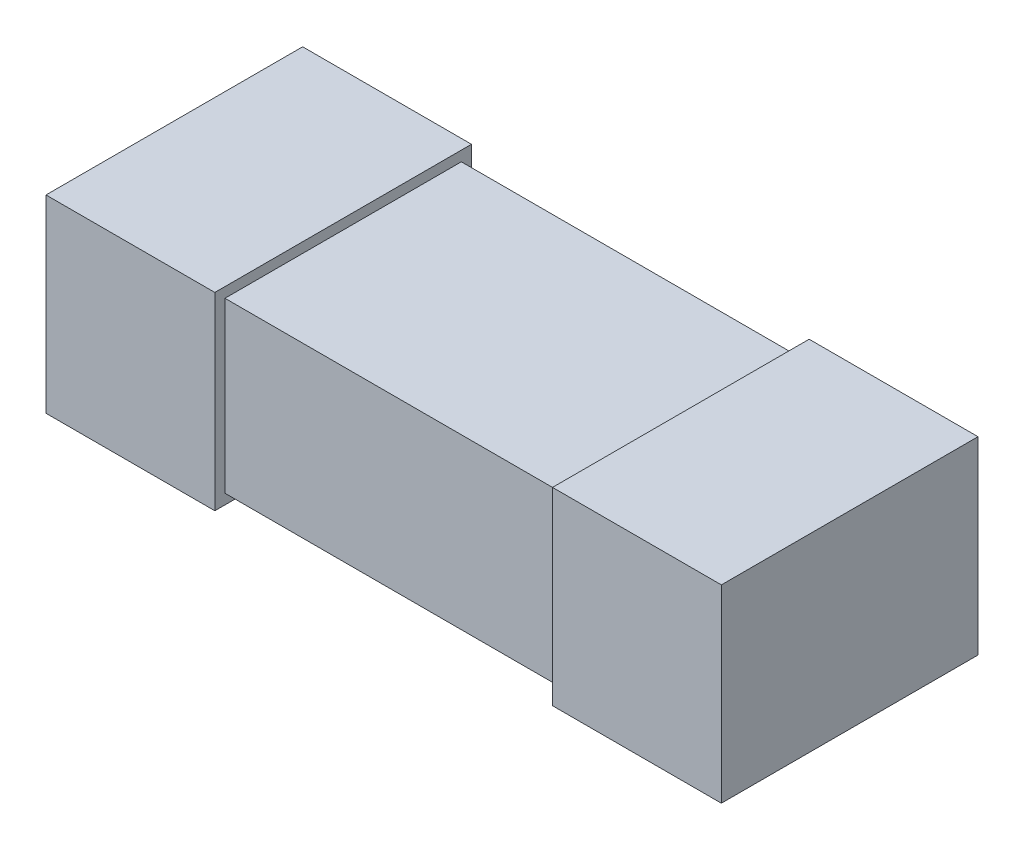
ISO-10303-21;
HEADER;
FILE_DESCRIPTION(('STEP AP214'),'2;1');
FILE_NAME('part.step','',(''),(''),'','','');
FILE_SCHEMA(('AUTOMOTIVE_DESIGN { 1 0 10303 214 1 1 1 1 }'));
ENDSEC;
DATA;
#1=APPLICATION_CONTEXT('core data for automotive mechanical design processes');
#2=APPLICATION_PROTOCOL_DEFINITION('international standard','automotive_design',2000,#1);
#3=PRODUCT_CONTEXT('',#1,'mechanical');
#4=PRODUCT('Part','Part','',(#3));
#5=PRODUCT_RELATED_PRODUCT_CATEGORY('part','',(#4));
#6=PRODUCT_DEFINITION_FORMATION('','',#4);
#7=PRODUCT_DEFINITION_CONTEXT('part definition',#1,'design');
#8=PRODUCT_DEFINITION('design','',#6,#7);
#9=PRODUCT_DEFINITION_SHAPE('','',#8);
#10=(LENGTH_UNIT() NAMED_UNIT(*) SI_UNIT(.MILLI.,.METRE.));
#11=(NAMED_UNIT(*) PLANE_ANGLE_UNIT() SI_UNIT($,.RADIAN.));
#12=(NAMED_UNIT(*) SI_UNIT($,.STERADIAN.) SOLID_ANGLE_UNIT());
#13=UNCERTAINTY_MEASURE_WITH_UNIT(LENGTH_MEASURE(1.E-05),#10,'distance_accuracy_value','');
#14=(GEOMETRIC_REPRESENTATION_CONTEXT(3) GLOBAL_UNCERTAINTY_ASSIGNED_CONTEXT((#13)) GLOBAL_UNIT_ASSIGNED_CONTEXT((#10,
#11,#12)) REPRESENTATION_CONTEXT('',''));
#15=CARTESIAN_POINT('',(0.,0.,0.));
#16=DIRECTION('',(0.,0.,1.));
#17=DIRECTION('',(1.,0.,0.));
#18=AXIS2_PLACEMENT_3D('',#15,#16,#17);
#19=CARTESIAN_POINT('',(-1.,0.5,0.35));
#20=DIRECTION('',(0.,0.,-1.));
#21=DIRECTION('',(-1.,0.,0.));
#22=AXIS2_PLACEMENT_3D('',#19,#20,#21);
#23=PLANE('',#22);
#24=DIRECTION('',(1.,0.,0.));
#25=VECTOR('',#24,1.);
#26=CARTESIAN_POINT('',(-1.,0.,0.35));
#27=LINE('',#26,#25);
#28=CARTESIAN_POINT('',(-0.5,0.,0.35));
#29=VERTEX_POINT('',#28);
#30=CARTESIAN_POINT('',(0.5,0.,0.35));
#31=VERTEX_POINT('',#30);
#32=EDGE_CURVE('E212',#29,#31,#27,.T.);
#33=ORIENTED_EDGE('',*,*,#32,.T.);
#34=DIRECTION('',(0.,1.,0.));
#35=VECTOR('',#34,1.);
#36=CARTESIAN_POINT('',(0.5,0.5,0.35));
#37=LINE('',#36,#35);
#38=CARTESIAN_POINT('',(0.5,0.5,0.35));
#39=VERTEX_POINT('',#38);
#40=EDGE_CURVE('E48',#31,#39,#37,.T.);
#41=ORIENTED_EDGE('',*,*,#40,.T.);
#42=DIRECTION('',(1.,0.,0.));
#43=VECTOR('',#42,1.);
#44=CARTESIAN_POINT('',(-1.,0.5,0.35));
#45=LINE('',#44,#43);
#46=CARTESIAN_POINT('',(-0.5,0.5,0.35));
#47=VERTEX_POINT('',#46);
#48=EDGE_CURVE('E213',#47,#39,#45,.T.);
#49=ORIENTED_EDGE('',*,*,#48,.F.);
#50=DIRECTION('',(0.,-1.,0.));
#51=VECTOR('',#50,1.);
#52=CARTESIAN_POINT('',(-0.5,0.5,0.35));
#53=LINE('',#52,#51);
#54=EDGE_CURVE('E207',#47,#29,#53,.T.);
#55=ORIENTED_EDGE('',*,*,#54,.T.);
#56=EDGE_LOOP('',(#33,#41,#49,#55));
#57=FACE_BOUND('',#56,.T.);
#58=ADVANCED_FACE('F33',(#57),#23,.F.);
#59=CARTESIAN_POINT('',(-1.,0.5,-0.35));
#60=DIRECTION('',(0.,0.,1.));
#61=DIRECTION('',(1.,0.,0.));
#62=AXIS2_PLACEMENT_3D('',#59,#60,#61);
#63=PLANE('',#62);
#64=DIRECTION('',(-1.,0.,0.));
#65=VECTOR('',#64,1.);
#66=CARTESIAN_POINT('',(-1.,0.5,-0.35));
#67=LINE('',#66,#65);
#68=CARTESIAN_POINT('',(0.5,0.5,-0.35));
#69=VERTEX_POINT('',#68);
#70=CARTESIAN_POINT('',(-0.5,0.5,-0.35));
#71=VERTEX_POINT('',#70);
#72=EDGE_CURVE('E215',#69,#71,#67,.T.);
#73=ORIENTED_EDGE('',*,*,#72,.F.);
#74=DIRECTION('',(0.,-1.,0.));
#75=VECTOR('',#74,1.);
#76=CARTESIAN_POINT('',(0.5,0.5,-0.35));
#77=LINE('',#76,#75);
#78=CARTESIAN_POINT('',(0.5,0.,-0.35));
#79=VERTEX_POINT('',#78);
#80=EDGE_CURVE('E163',#69,#79,#77,.T.);
#81=ORIENTED_EDGE('',*,*,#80,.T.);
#82=DIRECTION('',(-1.,0.,0.));
#83=VECTOR('',#82,1.);
#84=CARTESIAN_POINT('',(-1.,0.,-0.35));
#85=LINE('',#84,#83);
#86=CARTESIAN_POINT('',(-0.5,0.,-0.35));
#87=VERTEX_POINT('',#86);
#88=EDGE_CURVE('E216',#79,#87,#85,.T.);
#89=ORIENTED_EDGE('',*,*,#88,.T.);
#90=DIRECTION('',(0.,1.,0.));
#91=VECTOR('',#90,1.);
#92=CARTESIAN_POINT('',(-0.5,0.5,-0.35));
#93=LINE('',#92,#91);
#94=EDGE_CURVE('E199',#87,#71,#93,.T.);
#95=ORIENTED_EDGE('',*,*,#94,.T.);
#96=EDGE_LOOP('',(#73,#81,#89,#95));
#97=FACE_BOUND('',#96,.T.);
#98=ADVANCED_FACE('F231',(#97),#63,.F.);
#99=CARTESIAN_POINT('',(0.,0.5,0.));
#100=DIRECTION('',(0.,-1.,0.));
#101=DIRECTION('',(0.,0.,-1.));
#102=AXIS2_PLACEMENT_3D('',#99,#100,#101);
#103=PLANE('',#102);
#104=ORIENTED_EDGE('',*,*,#48,.T.);
#105=DIRECTION('',(0.,0.,-1.));
#106=VECTOR('',#105,1.);
#107=CARTESIAN_POINT('',(0.5,0.5,0.));
#108=LINE('',#107,#106);
#109=EDGE_CURVE('E55',#39,#69,#108,.T.);
#110=ORIENTED_EDGE('',*,*,#109,.T.);
#111=ORIENTED_EDGE('',*,*,#72,.T.);
#112=DIRECTION('',(0.,0.,1.));
#113=VECTOR('',#112,1.);
#114=CARTESIAN_POINT('',(-0.5,0.5,0.));
#115=LINE('',#114,#113);
#116=EDGE_CURVE('E210',#71,#47,#115,.T.);
#117=ORIENTED_EDGE('',*,*,#116,.T.);
#118=EDGE_LOOP('',(#104,#110,#111,#117));
#119=FACE_BOUND('',#118,.T.);
#120=ADVANCED_FACE('F228',(#119),#103,.F.);
#121=CARTESIAN_POINT('',(0.,0.,0.));
#122=DIRECTION('',(0.,-1.,0.));
#123=DIRECTION('',(0.,0.,-1.));
#124=AXIS2_PLACEMENT_3D('',#121,#122,#123);
#125=PLANE('',#124);
#126=DIRECTION('',(0.,0.,-1.));
#127=VECTOR('',#126,1.);
#128=CARTESIAN_POINT('',(0.5,0.,0.));
#129=LINE('',#128,#127);
#130=EDGE_CURVE('E11',#31,#79,#129,.T.);
#131=ORIENTED_EDGE('',*,*,#130,.F.);
#132=ORIENTED_EDGE('',*,*,#32,.F.);
#133=DIRECTION('',(0.,0.,1.));
#134=VECTOR('',#133,1.);
#135=CARTESIAN_POINT('',(-0.5,0.,0.));
#136=LINE('',#135,#134);
#137=EDGE_CURVE('E41',#87,#29,#136,.T.);
#138=ORIENTED_EDGE('',*,*,#137,.F.);
#139=ORIENTED_EDGE('',*,*,#88,.F.);
#140=EDGE_LOOP('',(#131,#132,#138,#139));
#141=FACE_BOUND('',#140,.T.);
#142=ADVANCED_FACE('F227',(#141),#125,.T.);
#143=CARTESIAN_POINT('',(-0.5,0.,0.));
#144=DIRECTION('',(1.,0.,0.));
#145=DIRECTION('',(0.,0.,-1.));
#146=AXIS2_PLACEMENT_3D('',#143,#144,#145);
#147=PLANE('',#146);
#148=DIRECTION('',(0.,-1.,0.));
#149=VECTOR('',#148,1.);
#150=CARTESIAN_POINT('',(-0.5,-0.03,-0.38));
#151=LINE('',#150,#149);
#152=CARTESIAN_POINT('',(-0.5,0.53,-0.38));
#153=VERTEX_POINT('',#152);
#154=CARTESIAN_POINT('',(-0.5,-0.03,-0.38));
#155=VERTEX_POINT('',#154);
#156=EDGE_CURVE('E173',#153,#155,#151,.T.);
#157=ORIENTED_EDGE('',*,*,#156,.F.);
#158=DIRECTION('',(0.,0.,-1.));
#159=VECTOR('',#158,1.);
#160=CARTESIAN_POINT('',(-0.5,0.53,-0.38));
#161=LINE('',#160,#159);
#162=CARTESIAN_POINT('',(-0.5,0.53,0.38));
#163=VERTEX_POINT('',#162);
#164=EDGE_CURVE('E183',#163,#153,#161,.T.);
#165=ORIENTED_EDGE('',*,*,#164,.F.);
#166=DIRECTION('',(0.,1.,0.));
#167=VECTOR('',#166,1.);
#168=CARTESIAN_POINT('',(-0.5,-0.03,0.38));
#169=LINE('',#168,#167);
#170=CARTESIAN_POINT('',(-0.5,-0.03,0.38));
#171=VERTEX_POINT('',#170);
#172=EDGE_CURVE('E180',#171,#163,#169,.T.);
#173=ORIENTED_EDGE('',*,*,#172,.F.);
#174=DIRECTION('',(0.,0.,1.));
#175=VECTOR('',#174,1.);
#176=CARTESIAN_POINT('',(-0.5,-0.03,-0.38));
#177=LINE('',#176,#175);
#178=EDGE_CURVE('E176',#155,#171,#177,.T.);
#179=ORIENTED_EDGE('',*,*,#178,.F.);
#180=EDGE_LOOP('',(#157,#165,#173,#179));
#181=FACE_BOUND('',#180,.T.);
#182=ORIENTED_EDGE('',*,*,#116,.F.);
#183=ORIENTED_EDGE('',*,*,#94,.F.);
#184=ORIENTED_EDGE('',*,*,#137,.T.);
#185=ORIENTED_EDGE('',*,*,#54,.F.);
#186=EDGE_LOOP('',(#182,#183,#184,#185));
#187=FACE_BOUND('',#186,.T.);
#188=ADVANCED_FACE('F225',(#181,#187),#147,.T.);
#189=CARTESIAN_POINT('',(-0.5,-0.03,-0.38));
#190=DIRECTION('',(0.,0.,-1.));
#191=DIRECTION('',(-1.,0.,0.));
#192=AXIS2_PLACEMENT_3D('',#189,#190,#191);
#193=PLANE('',#192);
#194=DIRECTION('',(0.,-1.,0.));
#195=VECTOR('',#194,1.);
#196=CARTESIAN_POINT('',(-1.,-0.03,-0.38));
#197=LINE('',#196,#195);
#198=CARTESIAN_POINT('',(-1.,0.53,-0.38));
#199=VERTEX_POINT('',#198);
#200=CARTESIAN_POINT('',(-1.,-0.03,-0.38));
#201=VERTEX_POINT('',#200);
#202=EDGE_CURVE('E172',#199,#201,#197,.T.);
#203=ORIENTED_EDGE('',*,*,#202,.F.);
#204=DIRECTION('',(-1.,0.,0.));
#205=VECTOR('',#204,1.);
#206=CARTESIAN_POINT('',(-0.5,0.53,-0.38));
#207=LINE('',#206,#205);
#208=EDGE_CURVE('E197',#153,#199,#207,.T.);
#209=ORIENTED_EDGE('',*,*,#208,.F.);
#210=ORIENTED_EDGE('',*,*,#156,.T.);
#211=DIRECTION('',(-1.,0.,0.));
#212=VECTOR('',#211,1.);
#213=CARTESIAN_POINT('',(-0.5,-0.03,-0.38));
#214=LINE('',#213,#212);
#215=EDGE_CURVE('E186',#155,#201,#214,.T.);
#216=ORIENTED_EDGE('',*,*,#215,.T.);
#217=EDGE_LOOP('',(#203,#209,#210,#216));
#218=FACE_BOUND('',#217,.T.);
#219=ADVANCED_FACE('F266',(#218),#193,.T.);
#220=CARTESIAN_POINT('',(-0.5,0.53,-0.38));
#221=DIRECTION('',(0.,1.,0.));
#222=DIRECTION('',(0.,0.,1.));
#223=AXIS2_PLACEMENT_3D('',#220,#221,#222);
#224=PLANE('',#223);
#225=DIRECTION('',(0.,0.,-1.));
#226=VECTOR('',#225,1.);
#227=CARTESIAN_POINT('',(-1.,0.53,-0.38));
#228=LINE('',#227,#226);
#229=CARTESIAN_POINT('',(-1.,0.53,0.38));
#230=VERTEX_POINT('',#229);
#231=EDGE_CURVE('E177',#230,#199,#228,.T.);
#232=ORIENTED_EDGE('',*,*,#231,.F.);
#233=DIRECTION('',(-1.,0.,0.));
#234=VECTOR('',#233,1.);
#235=CARTESIAN_POINT('',(-0.5,0.53,0.38));
#236=LINE('',#235,#234);
#237=EDGE_CURVE('E200',#163,#230,#236,.T.);
#238=ORIENTED_EDGE('',*,*,#237,.F.);
#239=ORIENTED_EDGE('',*,*,#164,.T.);
#240=ORIENTED_EDGE('',*,*,#208,.T.);
#241=EDGE_LOOP('',(#232,#238,#239,#240));
#242=FACE_BOUND('',#241,.T.);
#243=ADVANCED_FACE('F268',(#242),#224,.T.);
#244=CARTESIAN_POINT('',(-0.5,-0.03,0.38));
#245=DIRECTION('',(0.,0.,1.));
#246=DIRECTION('',(1.,0.,0.));
#247=AXIS2_PLACEMENT_3D('',#244,#245,#246);
#248=PLANE('',#247);
#249=DIRECTION('',(0.,1.,0.));
#250=VECTOR('',#249,1.);
#251=CARTESIAN_POINT('',(-1.,-0.03,0.38));
#252=LINE('',#251,#250);
#253=CARTESIAN_POINT('',(-1.,-0.03,0.38));
#254=VERTEX_POINT('',#253);
#255=EDGE_CURVE('E192',#254,#230,#252,.T.);
#256=ORIENTED_EDGE('',*,*,#255,.F.);
#257=DIRECTION('',(-1.,0.,0.));
#258=VECTOR('',#257,1.);
#259=CARTESIAN_POINT('',(-0.5,-0.03,0.38));
#260=LINE('',#259,#258);
#261=EDGE_CURVE('E202',#171,#254,#260,.T.);
#262=ORIENTED_EDGE('',*,*,#261,.F.);
#263=ORIENTED_EDGE('',*,*,#172,.T.);
#264=ORIENTED_EDGE('',*,*,#237,.T.);
#265=EDGE_LOOP('',(#256,#262,#263,#264));
#266=FACE_BOUND('',#265,.T.);
#267=ADVANCED_FACE('F271',(#266),#248,.T.);
#268=CARTESIAN_POINT('',(-0.5,-0.03,-0.38));
#269=DIRECTION('',(0.,-1.,0.));
#270=DIRECTION('',(0.,0.,-1.));
#271=AXIS2_PLACEMENT_3D('',#268,#269,#270);
#272=PLANE('',#271);
#273=DIRECTION('',(0.,0.,1.));
#274=VECTOR('',#273,1.);
#275=CARTESIAN_POINT('',(-1.,-0.03,-0.38));
#276=LINE('',#275,#274);
#277=EDGE_CURVE('E189',#201,#254,#276,.T.);
#278=ORIENTED_EDGE('',*,*,#277,.F.);
#279=ORIENTED_EDGE('',*,*,#215,.F.);
#280=ORIENTED_EDGE('',*,*,#178,.T.);
#281=ORIENTED_EDGE('',*,*,#261,.T.);
#282=EDGE_LOOP('',(#278,#279,#280,#281));
#283=FACE_BOUND('',#282,.T.);
#284=ADVANCED_FACE('F275',(#283),#272,.T.);
#285=CARTESIAN_POINT('',(-1.,0.5,0.35));
#286=DIRECTION('',(1.,0.,0.));
#287=DIRECTION('',(0.,0.,-1.));
#288=AXIS2_PLACEMENT_3D('',#285,#286,#287);
#289=PLANE('',#288);
#290=ORIENTED_EDGE('',*,*,#202,.T.);
#291=ORIENTED_EDGE('',*,*,#277,.T.);
#292=ORIENTED_EDGE('',*,*,#255,.T.);
#293=ORIENTED_EDGE('',*,*,#231,.T.);
#294=EDGE_LOOP('',(#290,#291,#292,#293));
#295=FACE_BOUND('',#294,.T.);
#296=ADVANCED_FACE('F35',(#295),#289,.F.);
#297=CARTESIAN_POINT('',(0.5,0.,0.));
#298=DIRECTION('',(-1.,0.,0.));
#299=DIRECTION('',(0.,0.,-1.));
#300=AXIS2_PLACEMENT_3D('',#297,#298,#299);
#301=PLANE('',#300);
#302=DIRECTION('',(0.,-1.,0.));
#303=VECTOR('',#302,1.);
#304=CARTESIAN_POINT('',(0.5,-0.03,-0.38));
#305=LINE('',#304,#303);
#306=CARTESIAN_POINT('',(0.5,0.53,-0.38));
#307=VERTEX_POINT('',#306);
#308=CARTESIAN_POINT('',(0.5,-0.03,-0.38));
#309=VERTEX_POINT('',#308);
#310=EDGE_CURVE('E129',#307,#309,#305,.T.);
#311=ORIENTED_EDGE('',*,*,#310,.T.);
#312=DIRECTION('',(0.,0.,1.));
#313=VECTOR('',#312,1.);
#314=CARTESIAN_POINT('',(0.5,-0.03,-0.38));
#315=LINE('',#314,#313);
#316=CARTESIAN_POINT('',(0.5,-0.03,0.38));
#317=VERTEX_POINT('',#316);
#318=EDGE_CURVE('E146',#309,#317,#315,.T.);
#319=ORIENTED_EDGE('',*,*,#318,.T.);
#320=DIRECTION('',(0.,1.,0.));
#321=VECTOR('',#320,1.);
#322=CARTESIAN_POINT('',(0.5,-0.03,0.38));
#323=LINE('',#322,#321);
#324=CARTESIAN_POINT('',(0.5,0.53,0.38));
#325=VERTEX_POINT('',#324);
#326=EDGE_CURVE('E132',#317,#325,#323,.T.);
#327=ORIENTED_EDGE('',*,*,#326,.T.);
#328=DIRECTION('',(0.,0.,-1.));
#329=VECTOR('',#328,1.);
#330=CARTESIAN_POINT('',(0.5,0.53,-0.38));
#331=LINE('',#330,#329);
#332=EDGE_CURVE('E124',#325,#307,#331,.T.);
#333=ORIENTED_EDGE('',*,*,#332,.T.);
#334=EDGE_LOOP('',(#311,#319,#327,#333));
#335=FACE_BOUND('',#334,.T.);
#336=ORIENTED_EDGE('',*,*,#109,.F.);
#337=ORIENTED_EDGE('',*,*,#40,.F.);
#338=ORIENTED_EDGE('',*,*,#130,.T.);
#339=ORIENTED_EDGE('',*,*,#80,.F.);
#340=EDGE_LOOP('',(#336,#337,#338,#339));
#341=FACE_BOUND('',#340,.T.);
#342=ADVANCED_FACE('F126',(#335,#341),#301,.T.);
#343=CARTESIAN_POINT('',(0.5,-0.03,-0.38));
#344=DIRECTION('',(0.,0.,1.));
#345=DIRECTION('',(1.,0.,0.));
#346=AXIS2_PLACEMENT_3D('',#343,#344,#345);
#347=PLANE('',#346);
#348=DIRECTION('',(0.,-1.,0.));
#349=VECTOR('',#348,1.);
#350=CARTESIAN_POINT('',(1.,-0.03,-0.38));
#351=LINE('',#350,#349);
#352=CARTESIAN_POINT('',(1.,0.53,-0.38));
#353=VERTEX_POINT('',#352);
#354=CARTESIAN_POINT('',(1.,-0.03,-0.38));
#355=VERTEX_POINT('',#354);
#356=EDGE_CURVE('E158',#353,#355,#351,.T.);
#357=ORIENTED_EDGE('',*,*,#356,.T.);
#358=DIRECTION('',(1.,0.,0.));
#359=VECTOR('',#358,1.);
#360=CARTESIAN_POINT('',(0.5,-0.03,-0.38));
#361=LINE('',#360,#359);
#362=EDGE_CURVE('E150',#309,#355,#361,.T.);
#363=ORIENTED_EDGE('',*,*,#362,.F.);
#364=ORIENTED_EDGE('',*,*,#310,.F.);
#365=DIRECTION('',(1.,0.,0.));
#366=VECTOR('',#365,1.);
#367=CARTESIAN_POINT('',(0.5,0.53,-0.38));
#368=LINE('',#367,#366);
#369=EDGE_CURVE('E138',#307,#353,#368,.T.);
#370=ORIENTED_EDGE('',*,*,#369,.T.);
#371=EDGE_LOOP('',(#357,#363,#364,#370));
#372=FACE_BOUND('',#371,.T.);
#373=ADVANCED_FACE('F148',(#372),#347,.F.);
#374=CARTESIAN_POINT('',(0.5,-0.03,-0.38));
#375=DIRECTION('',(0.,1.,0.));
#376=DIRECTION('',(0.,0.,1.));
#377=AXIS2_PLACEMENT_3D('',#374,#375,#376);
#378=PLANE('',#377);
#379=DIRECTION('',(0.,0.,1.));
#380=VECTOR('',#379,1.);
#381=CARTESIAN_POINT('',(1.,-0.03,-0.38));
#382=LINE('',#381,#380);
#383=CARTESIAN_POINT('',(1.,-0.03,0.38));
#384=VERTEX_POINT('',#383);
#385=EDGE_CURVE('E151',#355,#384,#382,.T.);
#386=ORIENTED_EDGE('',*,*,#385,.T.);
#387=DIRECTION('',(1.,0.,0.));
#388=VECTOR('',#387,1.);
#389=CARTESIAN_POINT('',(0.5,-0.03,0.38));
#390=LINE('',#389,#388);
#391=EDGE_CURVE('E164',#317,#384,#390,.T.);
#392=ORIENTED_EDGE('',*,*,#391,.F.);
#393=ORIENTED_EDGE('',*,*,#318,.F.);
#394=ORIENTED_EDGE('',*,*,#362,.T.);
#395=EDGE_LOOP('',(#386,#392,#393,#394));
#396=FACE_BOUND('',#395,.T.);
#397=ADVANCED_FACE('F252',(#396),#378,.F.);
#398=CARTESIAN_POINT('',(0.5,-0.03,0.38));
#399=DIRECTION('',(0.,0.,-1.));
#400=DIRECTION('',(-1.,0.,0.));
#401=AXIS2_PLACEMENT_3D('',#398,#399,#400);
#402=PLANE('',#401);
#403=DIRECTION('',(0.,1.,0.));
#404=VECTOR('',#403,1.);
#405=CARTESIAN_POINT('',(1.,-0.03,0.38));
#406=LINE('',#405,#404);
#407=CARTESIAN_POINT('',(1.,0.53,0.38));
#408=VERTEX_POINT('',#407);
#409=EDGE_CURVE('E153',#384,#408,#406,.T.);
#410=ORIENTED_EDGE('',*,*,#409,.T.);
#411=DIRECTION('',(1.,0.,0.));
#412=VECTOR('',#411,1.);
#413=CARTESIAN_POINT('',(0.5,0.53,0.38));
#414=LINE('',#413,#412);
#415=EDGE_CURVE('E145',#325,#408,#414,.T.);
#416=ORIENTED_EDGE('',*,*,#415,.F.);
#417=ORIENTED_EDGE('',*,*,#326,.F.);
#418=ORIENTED_EDGE('',*,*,#391,.T.);
#419=EDGE_LOOP('',(#410,#416,#417,#418));
#420=FACE_BOUND('',#419,.T.);
#421=ADVANCED_FACE('F247',(#420),#402,.F.);
#422=CARTESIAN_POINT('',(0.5,0.53,-0.38));
#423=DIRECTION('',(0.,-1.,0.));
#424=DIRECTION('',(0.,0.,-1.));
#425=AXIS2_PLACEMENT_3D('',#422,#423,#424);
#426=PLANE('',#425);
#427=DIRECTION('',(0.,0.,-1.));
#428=VECTOR('',#427,1.);
#429=CARTESIAN_POINT('',(1.,0.53,-0.38));
#430=LINE('',#429,#428);
#431=EDGE_CURVE('E141',#408,#353,#430,.T.);
#432=ORIENTED_EDGE('',*,*,#431,.T.);
#433=ORIENTED_EDGE('',*,*,#369,.F.);
#434=ORIENTED_EDGE('',*,*,#332,.F.);
#435=ORIENTED_EDGE('',*,*,#415,.T.);
#436=EDGE_LOOP('',(#432,#433,#434,#435));
#437=FACE_BOUND('',#436,.T.);
#438=ADVANCED_FACE('F139',(#437),#426,.F.);
#439=CARTESIAN_POINT('',(1.,0.5,0.35));
#440=DIRECTION('',(-1.,0.,0.));
#441=DIRECTION('',(0.,0.,1.));
#442=AXIS2_PLACEMENT_3D('',#439,#440,#441);
#443=PLANE('',#442);
#444=ORIENTED_EDGE('',*,*,#356,.F.);
#445=ORIENTED_EDGE('',*,*,#431,.F.);
#446=ORIENTED_EDGE('',*,*,#409,.F.);
#447=ORIENTED_EDGE('',*,*,#385,.F.);
#448=EDGE_LOOP('',(#444,#445,#446,#447));
#449=FACE_BOUND('',#448,.T.);
#450=ADVANCED_FACE('F241',(#449),#443,.F.);
#451=CLOSED_SHELL('',(#58,#98,#120,#142,#188,#219,#243,#267,#284,#296,#342,#373,#397,#421,#438,#450));
#452=MANIFOLD_SOLID_BREP('B2',#451);
#453=ADVANCED_BREP_SHAPE_REPRESENTATION('',(#18,#452),#14);
#454=SHAPE_DEFINITION_REPRESENTATION(#9,#453);
ENDSEC;
END-ISO-10303-21;
